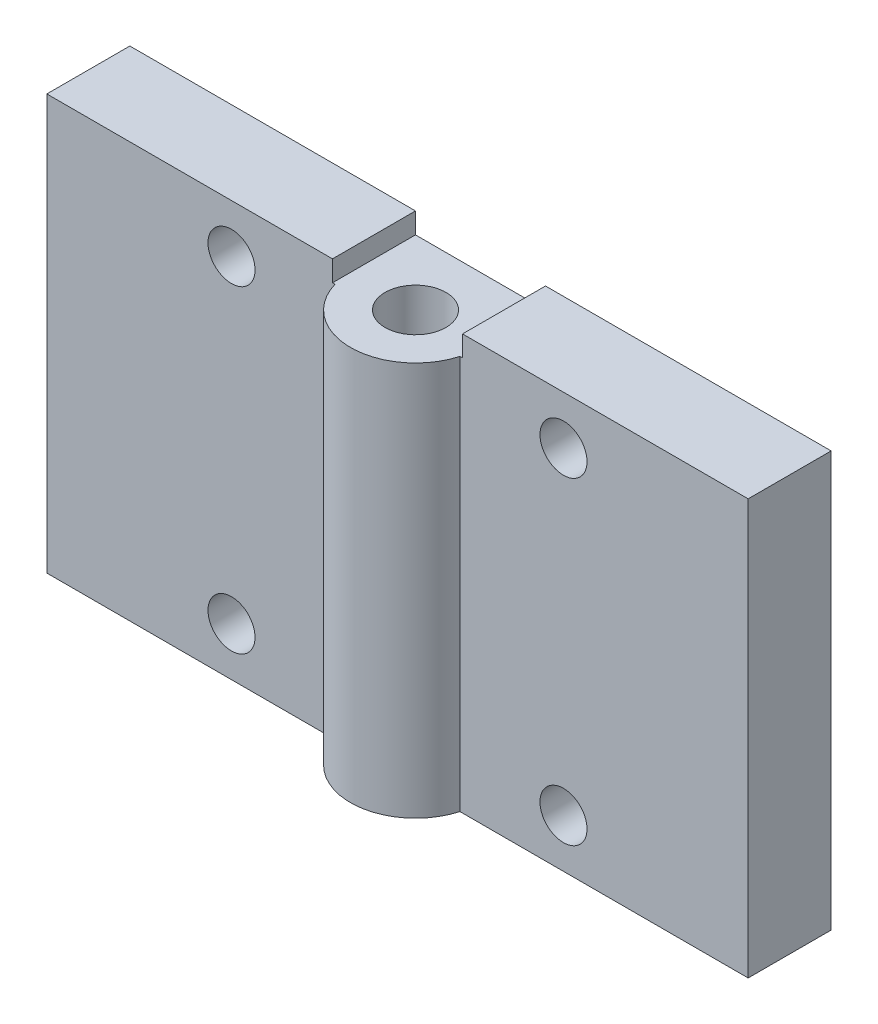
ISO-10303-21;
HEADER;
FILE_DESCRIPTION(('STEP AP214'),'2;1');
FILE_NAME('part.step','',(''),(''),'','','');
FILE_SCHEMA(('AUTOMOTIVE_DESIGN { 1 0 10303 214 1 1 1 1 }'));
ENDSEC;
DATA;
#1=APPLICATION_CONTEXT('core data for automotive mechanical design processes');
#2=APPLICATION_PROTOCOL_DEFINITION('international standard','automotive_design',2000,#1);
#3=PRODUCT_CONTEXT('',#1,'mechanical');
#4=PRODUCT('Part','Part','',(#3));
#5=PRODUCT_RELATED_PRODUCT_CATEGORY('part','',(#4));
#6=PRODUCT_DEFINITION_FORMATION('','',#4);
#7=PRODUCT_DEFINITION_CONTEXT('part definition',#1,'design');
#8=PRODUCT_DEFINITION('design','',#6,#7);
#9=PRODUCT_DEFINITION_SHAPE('','',#8);
#10=(LENGTH_UNIT() NAMED_UNIT(*) SI_UNIT(.MILLI.,.METRE.));
#11=(NAMED_UNIT(*) PLANE_ANGLE_UNIT() SI_UNIT($,.RADIAN.));
#12=(NAMED_UNIT(*) SI_UNIT($,.STERADIAN.) SOLID_ANGLE_UNIT());
#13=UNCERTAINTY_MEASURE_WITH_UNIT(LENGTH_MEASURE(1.E-05),#10,'distance_accuracy_value','');
#14=(GEOMETRIC_REPRESENTATION_CONTEXT(3) GLOBAL_UNCERTAINTY_ASSIGNED_CONTEXT((#13)) GLOBAL_UNIT_ASSIGNED_CONTEXT((#10,
#11,#12)) REPRESENTATION_CONTEXT('',''));
#15=CARTESIAN_POINT('',(0.,0.,0.));
#16=DIRECTION('',(0.,0.,1.));
#17=DIRECTION('',(1.,0.,0.));
#18=AXIS2_PLACEMENT_3D('',#15,#16,#17);
#19=CARTESIAN_POINT('',(260.,253.5,506.8));
#20=DIRECTION('',(0.,1.,0.));
#21=DIRECTION('',(0.,0.,1.));
#22=AXIS2_PLACEMENT_3D('',#19,#20,#21);
#23=PLANE('',#22);
#24=CARTESIAN_POINT('',(260.,253.5,506.8));
#25=DIRECTION('',(0.,1.,0.));
#26=DIRECTION('',(0.,0.,1.));
#27=AXIS2_PLACEMENT_3D('',#24,#25,#26);
#28=CIRCLE('',#27,2.19999999999998);
#29=CARTESIAN_POINT('',(260.,253.5,509.));
#30=VERTEX_POINT('',#29);
#31=EDGE_CURVE('E222',#30,#30,#28,.T.);
#32=ORIENTED_EDGE('',*,*,#31,.F.);
#33=EDGE_LOOP('',(#32));
#34=FACE_BOUND('',#33,.T.);
#35=DIRECTION('',(-1.,0.,0.));
#36=VECTOR('',#35,1.);
#37=CARTESIAN_POINT('',(285.35,253.5,502.1));
#38=LINE('',#37,#36);
#39=CARTESIAN_POINT('',(264.7,253.5,502.1));
#40=VERTEX_POINT('',#39);
#41=CARTESIAN_POINT('',(255.3,253.5,502.1));
#42=VERTEX_POINT('',#41);
#43=EDGE_CURVE('E54',#40,#42,#38,.T.);
#44=ORIENTED_EDGE('',*,*,#43,.T.);
#45=DIRECTION('',(0.,0.,-1.));
#46=VECTOR('',#45,1.);
#47=CARTESIAN_POINT('',(255.3,253.5,502.1));
#48=LINE('',#47,#46);
#49=CARTESIAN_POINT('',(255.3,253.5,508.1));
#50=VERTEX_POINT('',#49);
#51=EDGE_CURVE('E135',#50,#42,#48,.T.);
#52=ORIENTED_EDGE('',*,*,#51,.F.);
#53=DIRECTION('',(1.,0.,0.));
#54=VECTOR('',#53,1.);
#55=CARTESIAN_POINT('',(234.65,253.5,508.1));
#56=LINE('',#55,#54);
#57=CARTESIAN_POINT('',(255.483364083745,253.5,508.1));
#58=VERTEX_POINT('',#57);
#59=EDGE_CURVE('E166',#50,#58,#56,.T.);
#60=ORIENTED_EDGE('',*,*,#59,.T.);
#61=CARTESIAN_POINT('',(260.,253.5,506.8));
#62=DIRECTION('',(0.,1.,0.));
#63=DIRECTION('',(0.,0.,1.));
#64=AXIS2_PLACEMENT_3D('',#61,#62,#63);
#65=CIRCLE('',#64,4.70000000000001);
#66=CARTESIAN_POINT('',(264.516635916255,253.5,508.1));
#67=VERTEX_POINT('',#66);
#68=EDGE_CURVE('E161',#58,#67,#65,.T.);
#69=ORIENTED_EDGE('',*,*,#68,.T.);
#70=DIRECTION('',(1.,0.,0.));
#71=VECTOR('',#70,1.);
#72=CARTESIAN_POINT('',(264.516635916255,253.5,508.1));
#73=LINE('',#72,#71);
#74=CARTESIAN_POINT('',(264.7,253.5,508.1));
#75=VERTEX_POINT('',#74);
#76=EDGE_CURVE('E183',#67,#75,#73,.T.);
#77=ORIENTED_EDGE('',*,*,#76,.T.);
#78=DIRECTION('',(0.,0.,1.));
#79=VECTOR('',#78,1.);
#80=CARTESIAN_POINT('',(264.7,253.5,508.1));
#81=LINE('',#80,#79);
#82=EDGE_CURVE('E59',#40,#75,#81,.T.);
#83=ORIENTED_EDGE('',*,*,#82,.F.);
#84=EDGE_LOOP('',(#44,#52,#60,#69,#77,#83));
#85=FACE_BOUND('',#84,.T.);
#86=ADVANCED_FACE('F37',(#34,#85),#23,.T.);
#87=CARTESIAN_POINT('',(260.,225.,506.8));
#88=DIRECTION('',(0.,1.,0.));
#89=DIRECTION('',(0.,0.,1.));
#90=AXIS2_PLACEMENT_3D('',#87,#88,#89);
#91=CYLINDRICAL_SURFACE('',#90,4.70000000000001);
#92=ORIENTED_EDGE('',*,*,#68,.F.);
#93=DIRECTION('',(0.,1.,0.));
#94=VECTOR('',#93,1.);
#95=CARTESIAN_POINT('',(255.483364083745,225.,508.1));
#96=LINE('',#95,#94);
#97=CARTESIAN_POINT('',(255.483364083745,225.,508.1));
#98=VERTEX_POINT('',#97);
#99=EDGE_CURVE('E11',#98,#58,#96,.T.);
#100=ORIENTED_EDGE('',*,*,#99,.F.);
#101=CARTESIAN_POINT('',(260.,225.,506.8));
#102=DIRECTION('',(0.,1.,0.));
#103=DIRECTION('',(0.,0.,1.));
#104=AXIS2_PLACEMENT_3D('',#101,#102,#103);
#105=CIRCLE('',#104,4.70000000000001);
#106=CARTESIAN_POINT('',(264.516635916255,225.,508.1));
#107=VERTEX_POINT('',#106);
#108=EDGE_CURVE('E162',#98,#107,#105,.T.);
#109=ORIENTED_EDGE('',*,*,#108,.T.);
#110=DIRECTION('',(0.,1.,0.));
#111=VECTOR('',#110,1.);
#112=CARTESIAN_POINT('',(264.516635916255,225.,508.1));
#113=LINE('',#112,#111);
#114=EDGE_CURVE('E180',#107,#67,#113,.T.);
#115=ORIENTED_EDGE('',*,*,#114,.T.);
#116=EDGE_LOOP('',(#92,#100,#109,#115));
#117=FACE_BOUND('',#116,.T.);
#118=ADVANCED_FACE('F39',(#117),#91,.T.);
#119=CARTESIAN_POINT('',(234.65,225.,508.1));
#120=DIRECTION('',(0.,0.,1.));
#121=DIRECTION('',(1.,0.,0.));
#122=AXIS2_PLACEMENT_3D('',#119,#120,#121);
#123=PLANE('',#122);
#124=CARTESIAN_POINT('',(248.,228.5,508.1));
#125=DIRECTION('',(0.,0.,1.));
#126=DIRECTION('',(1.,0.,0.));
#127=AXIS2_PLACEMENT_3D('',#124,#125,#126);
#128=CIRCLE('',#127,1.70000000000001);
#129=CARTESIAN_POINT('',(249.7,228.5,508.1));
#130=VERTEX_POINT('',#129);
#131=EDGE_CURVE('E244',#130,#130,#128,.T.);
#132=ORIENTED_EDGE('',*,*,#131,.F.);
#133=EDGE_LOOP('',(#132));
#134=FACE_BOUND('',#133,.T.);
#135=CARTESIAN_POINT('',(248.,251.5,508.1));
#136=DIRECTION('',(0.,0.,1.));
#137=DIRECTION('',(1.,0.,0.));
#138=AXIS2_PLACEMENT_3D('',#135,#136,#137);
#139=CIRCLE('',#138,1.70000000000001);
#140=CARTESIAN_POINT('',(249.7,251.5,508.1));
#141=VERTEX_POINT('',#140);
#142=EDGE_CURVE('E238',#141,#141,#139,.T.);
#143=ORIENTED_EDGE('',*,*,#142,.F.);
#144=EDGE_LOOP('',(#143));
#145=FACE_BOUND('',#144,.T.);
#146=ORIENTED_EDGE('',*,*,#59,.F.);
#147=DIRECTION('',(0.,-1.,0.));
#148=VECTOR('',#147,1.);
#149=CARTESIAN_POINT('',(255.3,255.,508.1));
#150=LINE('',#149,#148);
#151=CARTESIAN_POINT('',(255.3,255.,508.1));
#152=VERTEX_POINT('',#151);
#153=EDGE_CURVE('E138',#152,#50,#150,.T.);
#154=ORIENTED_EDGE('',*,*,#153,.F.);
#155=DIRECTION('',(1.,0.,0.));
#156=VECTOR('',#155,1.);
#157=CARTESIAN_POINT('',(255.3,255.,508.1));
#158=LINE('',#157,#156);
#159=CARTESIAN_POINT('',(234.65,255.,508.1));
#160=VERTEX_POINT('',#159);
#161=EDGE_CURVE('E131',#160,#152,#158,.T.);
#162=ORIENTED_EDGE('',*,*,#161,.F.);
#163=DIRECTION('',(0.,1.,0.));
#164=VECTOR('',#163,1.);
#165=CARTESIAN_POINT('',(234.65,225.,508.1));
#166=LINE('',#165,#164);
#167=CARTESIAN_POINT('',(234.65,225.,508.1));
#168=VERTEX_POINT('',#167);
#169=EDGE_CURVE('E46',#168,#160,#166,.T.);
#170=ORIENTED_EDGE('',*,*,#169,.F.);
#171=DIRECTION('',(1.,0.,0.));
#172=VECTOR('',#171,1.);
#173=CARTESIAN_POINT('',(234.65,225.,508.1));
#174=LINE('',#173,#172);
#175=EDGE_CURVE('E177',#168,#98,#174,.T.);
#176=ORIENTED_EDGE('',*,*,#175,.T.);
#177=ORIENTED_EDGE('',*,*,#99,.T.);
#178=EDGE_LOOP('',(#146,#154,#162,#170,#176,#177));
#179=FACE_BOUND('',#178,.T.);
#180=ADVANCED_FACE('F201',(#134,#145,#179),#123,.T.);
#181=CARTESIAN_POINT('',(234.65,225.,502.1));
#182=DIRECTION('',(-1.,0.,0.));
#183=DIRECTION('',(0.,0.,1.));
#184=AXIS2_PLACEMENT_3D('',#181,#182,#183);
#185=PLANE('',#184);
#186=ORIENTED_EDGE('',*,*,#169,.T.);
#187=DIRECTION('',(0.,0.,1.));
#188=VECTOR('',#187,1.);
#189=CARTESIAN_POINT('',(234.65,255.,508.1));
#190=LINE('',#189,#188);
#191=CARTESIAN_POINT('',(234.65,255.,502.1));
#192=VERTEX_POINT('',#191);
#193=EDGE_CURVE('E125',#192,#160,#190,.T.);
#194=ORIENTED_EDGE('',*,*,#193,.F.);
#195=DIRECTION('',(0.,1.,0.));
#196=VECTOR('',#195,1.);
#197=CARTESIAN_POINT('',(234.65,225.,502.1));
#198=LINE('',#197,#196);
#199=CARTESIAN_POINT('',(234.65,225.,502.1));
#200=VERTEX_POINT('',#199);
#201=EDGE_CURVE('E121',#200,#192,#198,.T.);
#202=ORIENTED_EDGE('',*,*,#201,.F.);
#203=DIRECTION('',(0.,0.,1.));
#204=VECTOR('',#203,1.);
#205=CARTESIAN_POINT('',(234.65,225.,502.1));
#206=LINE('',#205,#204);
#207=EDGE_CURVE('E174',#200,#168,#206,.T.);
#208=ORIENTED_EDGE('',*,*,#207,.T.);
#209=EDGE_LOOP('',(#186,#194,#202,#208));
#210=FACE_BOUND('',#209,.T.);
#211=ADVANCED_FACE('F217',(#210),#185,.T.);
#212=CARTESIAN_POINT('',(285.35,225.,502.1));
#213=DIRECTION('',(0.,0.,-1.));
#214=DIRECTION('',(-1.,0.,0.));
#215=AXIS2_PLACEMENT_3D('',#212,#213,#214);
#216=PLANE('',#215);
#217=CARTESIAN_POINT('',(248.,228.5,502.1));
#218=DIRECTION('',(0.,0.,-1.));
#219=DIRECTION('',(-1.,0.,0.));
#220=AXIS2_PLACEMENT_3D('',#217,#218,#219);
#221=CIRCLE('',#220,1.70000000000001);
#222=CARTESIAN_POINT('',(246.3,228.5,502.1));
#223=VERTEX_POINT('',#222);
#224=EDGE_CURVE('E247',#223,#223,#221,.T.);
#225=ORIENTED_EDGE('',*,*,#224,.F.);
#226=EDGE_LOOP('',(#225));
#227=FACE_BOUND('',#226,.T.);
#228=CARTESIAN_POINT('',(248.,251.5,502.1));
#229=DIRECTION('',(0.,0.,-1.));
#230=DIRECTION('',(-1.,0.,0.));
#231=AXIS2_PLACEMENT_3D('',#228,#229,#230);
#232=CIRCLE('',#231,1.70000000000001);
#233=CARTESIAN_POINT('',(246.3,251.5,502.1));
#234=VERTEX_POINT('',#233);
#235=EDGE_CURVE('E241',#234,#234,#232,.T.);
#236=ORIENTED_EDGE('',*,*,#235,.F.);
#237=EDGE_LOOP('',(#236));
#238=FACE_BOUND('',#237,.T.);
#239=CARTESIAN_POINT('',(272.,251.5,502.1));
#240=DIRECTION('',(0.,0.,-1.));
#241=DIRECTION('',(-1.,0.,0.));
#242=AXIS2_PLACEMENT_3D('',#239,#240,#241);
#243=CIRCLE('',#242,1.69999999999998);
#244=CARTESIAN_POINT('',(270.3,251.5,502.1));
#245=VERTEX_POINT('',#244);
#246=EDGE_CURVE('E235',#245,#245,#243,.T.);
#247=ORIENTED_EDGE('',*,*,#246,.F.);
#248=EDGE_LOOP('',(#247));
#249=FACE_BOUND('',#248,.T.);
#250=CARTESIAN_POINT('',(272.,228.5,502.1));
#251=DIRECTION('',(0.,0.,-1.));
#252=DIRECTION('',(-1.,0.,0.));
#253=AXIS2_PLACEMENT_3D('',#250,#251,#252);
#254=CIRCLE('',#253,1.69999999999998);
#255=CARTESIAN_POINT('',(270.3,228.5,502.1));
#256=VERTEX_POINT('',#255);
#257=EDGE_CURVE('E232',#256,#256,#254,.T.);
#258=ORIENTED_EDGE('',*,*,#257,.F.);
#259=EDGE_LOOP('',(#258));
#260=FACE_BOUND('',#259,.T.);
#261=ORIENTED_EDGE('',*,*,#43,.F.);
#262=DIRECTION('',(0.,-1.,0.));
#263=VECTOR('',#262,1.);
#264=CARTESIAN_POINT('',(264.7,255.,502.1));
#265=LINE('',#264,#263);
#266=CARTESIAN_POINT('',(264.7,255.,502.1));
#267=VERTEX_POINT('',#266);
#268=EDGE_CURVE('E154',#267,#40,#265,.T.);
#269=ORIENTED_EDGE('',*,*,#268,.F.);
#270=DIRECTION('',(-1.,0.,0.));
#271=VECTOR('',#270,1.);
#272=CARTESIAN_POINT('',(264.7,255.,502.1));
#273=LINE('',#272,#271);
#274=CARTESIAN_POINT('',(285.35,255.,502.1));
#275=VERTEX_POINT('',#274);
#276=EDGE_CURVE('E153',#275,#267,#273,.T.);
#277=ORIENTED_EDGE('',*,*,#276,.F.);
#278=DIRECTION('',(0.,1.,0.));
#279=VECTOR('',#278,1.);
#280=CARTESIAN_POINT('',(285.35,225.,502.1));
#281=LINE('',#280,#279);
#282=CARTESIAN_POINT('',(285.35,225.,502.1));
#283=VERTEX_POINT('',#282);
#284=EDGE_CURVE('E189',#283,#275,#281,.T.);
#285=ORIENTED_EDGE('',*,*,#284,.F.);
#286=DIRECTION('',(-1.,0.,0.));
#287=VECTOR('',#286,1.);
#288=CARTESIAN_POINT('',(285.35,225.,502.1));
#289=LINE('',#288,#287);
#290=EDGE_CURVE('E172',#283,#200,#289,.T.);
#291=ORIENTED_EDGE('',*,*,#290,.T.);
#292=ORIENTED_EDGE('',*,*,#201,.T.);
#293=DIRECTION('',(-1.,0.,0.));
#294=VECTOR('',#293,1.);
#295=CARTESIAN_POINT('',(234.65,255.,502.1));
#296=LINE('',#295,#294);
#297=CARTESIAN_POINT('',(255.3,255.,502.1));
#298=VERTEX_POINT('',#297);
#299=EDGE_CURVE('E114',#298,#192,#296,.T.);
#300=ORIENTED_EDGE('',*,*,#299,.F.);
#301=DIRECTION('',(0.,-1.,0.));
#302=VECTOR('',#301,1.);
#303=CARTESIAN_POINT('',(255.3,255.,502.1));
#304=LINE('',#303,#302);
#305=EDGE_CURVE('E118',#298,#42,#304,.T.);
#306=ORIENTED_EDGE('',*,*,#305,.T.);
#307=EDGE_LOOP('',(#261,#269,#277,#285,#291,#292,#300,#306));
#308=FACE_BOUND('',#307,.T.);
#309=ADVANCED_FACE('F116',(#227,#238,#249,#260,#308),#216,.T.);
#310=CARTESIAN_POINT('',(285.35,225.,508.1));
#311=DIRECTION('',(1.,0.,0.));
#312=DIRECTION('',(0.,0.,-1.));
#313=AXIS2_PLACEMENT_3D('',#310,#311,#312);
#314=PLANE('',#313);
#315=ORIENTED_EDGE('',*,*,#284,.T.);
#316=DIRECTION('',(0.,0.,-1.));
#317=VECTOR('',#316,1.);
#318=CARTESIAN_POINT('',(285.35,255.,502.1));
#319=LINE('',#318,#317);
#320=CARTESIAN_POINT('',(285.35,255.,508.1));
#321=VERTEX_POINT('',#320);
#322=EDGE_CURVE('E150',#321,#275,#319,.T.);
#323=ORIENTED_EDGE('',*,*,#322,.F.);
#324=DIRECTION('',(0.,1.,0.));
#325=VECTOR('',#324,1.);
#326=CARTESIAN_POINT('',(285.35,225.,508.1));
#327=LINE('',#326,#325);
#328=CARTESIAN_POINT('',(285.35,225.,508.1));
#329=VERTEX_POINT('',#328);
#330=EDGE_CURVE('E191',#329,#321,#327,.T.);
#331=ORIENTED_EDGE('',*,*,#330,.F.);
#332=DIRECTION('',(0.,0.,-1.));
#333=VECTOR('',#332,1.);
#334=CARTESIAN_POINT('',(285.35,225.,508.1));
#335=LINE('',#334,#333);
#336=EDGE_CURVE('E169',#329,#283,#335,.T.);
#337=ORIENTED_EDGE('',*,*,#336,.T.);
#338=EDGE_LOOP('',(#315,#323,#331,#337));
#339=FACE_BOUND('',#338,.T.);
#340=ADVANCED_FACE('F214',(#339),#314,.T.);
#341=CARTESIAN_POINT('',(264.516635916255,225.,508.1));
#342=DIRECTION('',(0.,0.,1.));
#343=DIRECTION('',(1.,0.,0.));
#344=AXIS2_PLACEMENT_3D('',#341,#342,#343);
#345=PLANE('',#344);
#346=CARTESIAN_POINT('',(272.,251.5,508.1));
#347=DIRECTION('',(0.,0.,1.));
#348=DIRECTION('',(1.,0.,0.));
#349=AXIS2_PLACEMENT_3D('',#346,#347,#348);
#350=CIRCLE('',#349,1.69999999999998);
#351=CARTESIAN_POINT('',(273.7,251.5,508.1));
#352=VERTEX_POINT('',#351);
#353=EDGE_CURVE('E41',#352,#352,#350,.T.);
#354=ORIENTED_EDGE('',*,*,#353,.F.);
#355=EDGE_LOOP('',(#354));
#356=FACE_BOUND('',#355,.T.);
#357=CARTESIAN_POINT('',(272.,228.5,508.1));
#358=DIRECTION('',(0.,0.,1.));
#359=DIRECTION('',(1.,0.,0.));
#360=AXIS2_PLACEMENT_3D('',#357,#358,#359);
#361=CIRCLE('',#360,1.69999999999998);
#362=CARTESIAN_POINT('',(273.7,228.5,508.1));
#363=VERTEX_POINT('',#362);
#364=EDGE_CURVE('E227',#363,#363,#361,.T.);
#365=ORIENTED_EDGE('',*,*,#364,.F.);
#366=EDGE_LOOP('',(#365));
#367=FACE_BOUND('',#366,.T.);
#368=ORIENTED_EDGE('',*,*,#76,.F.);
#369=ORIENTED_EDGE('',*,*,#114,.F.);
#370=DIRECTION('',(1.,0.,0.));
#371=VECTOR('',#370,1.);
#372=CARTESIAN_POINT('',(264.516635916255,225.,508.1));
#373=LINE('',#372,#371);
#374=EDGE_CURVE('E165',#107,#329,#373,.T.);
#375=ORIENTED_EDGE('',*,*,#374,.T.);
#376=ORIENTED_EDGE('',*,*,#330,.T.);
#377=DIRECTION('',(1.,0.,0.));
#378=VECTOR('',#377,1.);
#379=CARTESIAN_POINT('',(285.35,255.,508.1));
#380=LINE('',#379,#378);
#381=CARTESIAN_POINT('',(264.7,255.,508.1));
#382=VERTEX_POINT('',#381);
#383=EDGE_CURVE('E147',#382,#321,#380,.T.);
#384=ORIENTED_EDGE('',*,*,#383,.F.);
#385=DIRECTION('',(0.,-1.,0.));
#386=VECTOR('',#385,1.);
#387=CARTESIAN_POINT('',(264.7,255.,508.1));
#388=LINE('',#387,#386);
#389=EDGE_CURVE('E158',#382,#75,#388,.T.);
#390=ORIENTED_EDGE('',*,*,#389,.T.);
#391=EDGE_LOOP('',(#368,#369,#375,#376,#384,#390));
#392=FACE_BOUND('',#391,.T.);
#393=ADVANCED_FACE('F198',(#356,#367,#392),#345,.T.);
#394=CARTESIAN_POINT('',(260.,225.,506.8));
#395=DIRECTION('',(0.,1.,0.));
#396=DIRECTION('',(0.,0.,1.));
#397=AXIS2_PLACEMENT_3D('',#394,#395,#396);
#398=PLANE('',#397);
#399=CARTESIAN_POINT('',(260.,225.,506.8));
#400=DIRECTION('',(0.,1.,0.));
#401=DIRECTION('',(0.,0.,1.));
#402=AXIS2_PLACEMENT_3D('',#399,#400,#401);
#403=CIRCLE('',#402,2.19999999999998);
#404=CARTESIAN_POINT('',(260.,225.,509.));
#405=VERTEX_POINT('',#404);
#406=EDGE_CURVE('E220',#405,#405,#403,.T.);
#407=ORIENTED_EDGE('',*,*,#406,.T.);
#408=EDGE_LOOP('',(#407));
#409=FACE_BOUND('',#408,.T.);
#410=ORIENTED_EDGE('',*,*,#108,.F.);
#411=ORIENTED_EDGE('',*,*,#175,.F.);
#412=ORIENTED_EDGE('',*,*,#207,.F.);
#413=ORIENTED_EDGE('',*,*,#290,.F.);
#414=ORIENTED_EDGE('',*,*,#336,.F.);
#415=ORIENTED_EDGE('',*,*,#374,.F.);
#416=EDGE_LOOP('',(#410,#411,#412,#413,#414,#415));
#417=FACE_BOUND('',#416,.T.);
#418=ADVANCED_FACE('F204',(#409,#417),#398,.F.);
#419=CARTESIAN_POINT('',(264.7,255.,508.1));
#420=DIRECTION('',(1.,0.,0.));
#421=DIRECTION('',(0.,0.,-1.));
#422=AXIS2_PLACEMENT_3D('',#419,#420,#421);
#423=PLANE('',#422);
#424=ORIENTED_EDGE('',*,*,#82,.T.);
#425=ORIENTED_EDGE('',*,*,#389,.F.);
#426=DIRECTION('',(0.,0.,1.));
#427=VECTOR('',#426,1.);
#428=CARTESIAN_POINT('',(264.7,255.,508.1));
#429=LINE('',#428,#427);
#430=EDGE_CURVE('E140',#267,#382,#429,.T.);
#431=ORIENTED_EDGE('',*,*,#430,.F.);
#432=ORIENTED_EDGE('',*,*,#268,.T.);
#433=EDGE_LOOP('',(#424,#425,#431,#432));
#434=FACE_BOUND('',#433,.T.);
#435=ADVANCED_FACE('F298',(#434),#423,.F.);
#436=CARTESIAN_POINT('',(0.,255.,0.));
#437=DIRECTION('',(0.,-1.,0.));
#438=DIRECTION('',(0.,0.,-1.));
#439=AXIS2_PLACEMENT_3D('',#436,#437,#438);
#440=PLANE('',#439);
#441=ORIENTED_EDGE('',*,*,#430,.T.);
#442=ORIENTED_EDGE('',*,*,#383,.T.);
#443=ORIENTED_EDGE('',*,*,#322,.T.);
#444=ORIENTED_EDGE('',*,*,#276,.T.);
#445=EDGE_LOOP('',(#441,#442,#443,#444));
#446=FACE_BOUND('',#445,.T.);
#447=ADVANCED_FACE('F211',(#446),#440,.F.);
#448=CARTESIAN_POINT('',(255.3,255.,502.1));
#449=DIRECTION('',(-1.,0.,0.));
#450=DIRECTION('',(0.,0.,1.));
#451=AXIS2_PLACEMENT_3D('',#448,#449,#450);
#452=PLANE('',#451);
#453=ORIENTED_EDGE('',*,*,#51,.T.);
#454=ORIENTED_EDGE('',*,*,#305,.F.);
#455=DIRECTION('',(0.,0.,-1.));
#456=VECTOR('',#455,1.);
#457=CARTESIAN_POINT('',(255.3,255.,502.1));
#458=LINE('',#457,#456);
#459=EDGE_CURVE('E126',#152,#298,#458,.T.);
#460=ORIENTED_EDGE('',*,*,#459,.F.);
#461=ORIENTED_EDGE('',*,*,#153,.T.);
#462=EDGE_LOOP('',(#453,#454,#460,#461));
#463=FACE_BOUND('',#462,.T.);
#464=ADVANCED_FACE('F137',(#463),#452,.F.);
#465=CARTESIAN_POINT('',(0.,255.,0.));
#466=DIRECTION('',(0.,-1.,0.));
#467=DIRECTION('',(0.,0.,-1.));
#468=AXIS2_PLACEMENT_3D('',#465,#466,#467);
#469=PLANE('',#468);
#470=ORIENTED_EDGE('',*,*,#459,.T.);
#471=ORIENTED_EDGE('',*,*,#299,.T.);
#472=ORIENTED_EDGE('',*,*,#193,.T.);
#473=ORIENTED_EDGE('',*,*,#161,.T.);
#474=EDGE_LOOP('',(#470,#471,#472,#473));
#475=FACE_BOUND('',#474,.T.);
#476=ADVANCED_FACE('F129',(#475),#469,.F.);
#477=CARTESIAN_POINT('',(260.,253.5,506.8));
#478=DIRECTION('',(0.,1.,0.));
#479=DIRECTION('',(0.,0.,1.));
#480=AXIS2_PLACEMENT_3D('',#477,#478,#479);
#481=CYLINDRICAL_SURFACE('',#480,2.19999999999998);
#482=ORIENTED_EDGE('',*,*,#406,.F.);
#483=EDGE_LOOP('',(#482));
#484=FACE_BOUND('',#483,.T.);
#485=ORIENTED_EDGE('',*,*,#31,.T.);
#486=EDGE_LOOP('',(#485));
#487=FACE_BOUND('',#486,.T.);
#488=ADVANCED_FACE('F265',(#484,#487),#481,.F.);
#489=CARTESIAN_POINT('',(272.,228.5,502.1));
#490=DIRECTION('',(0.,0.,-1.));
#491=DIRECTION('',(-1.,0.,0.));
#492=AXIS2_PLACEMENT_3D('',#489,#490,#491);
#493=CYLINDRICAL_SURFACE('',#492,1.69999999999998);
#494=ORIENTED_EDGE('',*,*,#364,.T.);
#495=EDGE_LOOP('',(#494));
#496=FACE_BOUND('',#495,.T.);
#497=ORIENTED_EDGE('',*,*,#257,.T.);
#498=EDGE_LOOP('',(#497));
#499=FACE_BOUND('',#498,.T.);
#500=ADVANCED_FACE('F262',(#496,#499),#493,.F.);
#501=CARTESIAN_POINT('',(272.,251.5,502.1));
#502=DIRECTION('',(0.,0.,-1.));
#503=DIRECTION('',(-1.,0.,0.));
#504=AXIS2_PLACEMENT_3D('',#501,#502,#503);
#505=CYLINDRICAL_SURFACE('',#504,1.69999999999998);
#506=ORIENTED_EDGE('',*,*,#353,.T.);
#507=EDGE_LOOP('',(#506));
#508=FACE_BOUND('',#507,.T.);
#509=ORIENTED_EDGE('',*,*,#246,.T.);
#510=EDGE_LOOP('',(#509));
#511=FACE_BOUND('',#510,.T.);
#512=ADVANCED_FACE('F264',(#508,#511),#505,.F.);
#513=CARTESIAN_POINT('',(248.,251.5,502.1));
#514=DIRECTION('',(0.,0.,-1.));
#515=DIRECTION('',(-1.,0.,0.));
#516=AXIS2_PLACEMENT_3D('',#513,#514,#515);
#517=CYLINDRICAL_SURFACE('',#516,1.70000000000001);
#518=ORIENTED_EDGE('',*,*,#142,.T.);
#519=EDGE_LOOP('',(#518));
#520=FACE_BOUND('',#519,.T.);
#521=ORIENTED_EDGE('',*,*,#235,.T.);
#522=EDGE_LOOP('',(#521));
#523=FACE_BOUND('',#522,.T.);
#524=ADVANCED_FACE('F272',(#520,#523),#517,.F.);
#525=CARTESIAN_POINT('',(248.,228.5,502.1));
#526=DIRECTION('',(0.,0.,-1.));
#527=DIRECTION('',(-1.,0.,0.));
#528=AXIS2_PLACEMENT_3D('',#525,#526,#527);
#529=CYLINDRICAL_SURFACE('',#528,1.70000000000001);
#530=ORIENTED_EDGE('',*,*,#131,.T.);
#531=EDGE_LOOP('',(#530));
#532=FACE_BOUND('',#531,.T.);
#533=ORIENTED_EDGE('',*,*,#224,.T.);
#534=EDGE_LOOP('',(#533));
#535=FACE_BOUND('',#534,.T.);
#536=ADVANCED_FACE('F251',(#532,#535),#529,.F.);
#537=CLOSED_SHELL('',(#86,#118,#180,#211,#309,#340,#393,#418,#435,#447,#464,#476,#488,#500,#512,
#524,#536));
#538=MANIFOLD_SOLID_BREP('B2',#537);
#539=ADVANCED_BREP_SHAPE_REPRESENTATION('',(#18,#538),#14);
#540=SHAPE_DEFINITION_REPRESENTATION(#9,#539);
ENDSEC;
END-ISO-10303-21;
